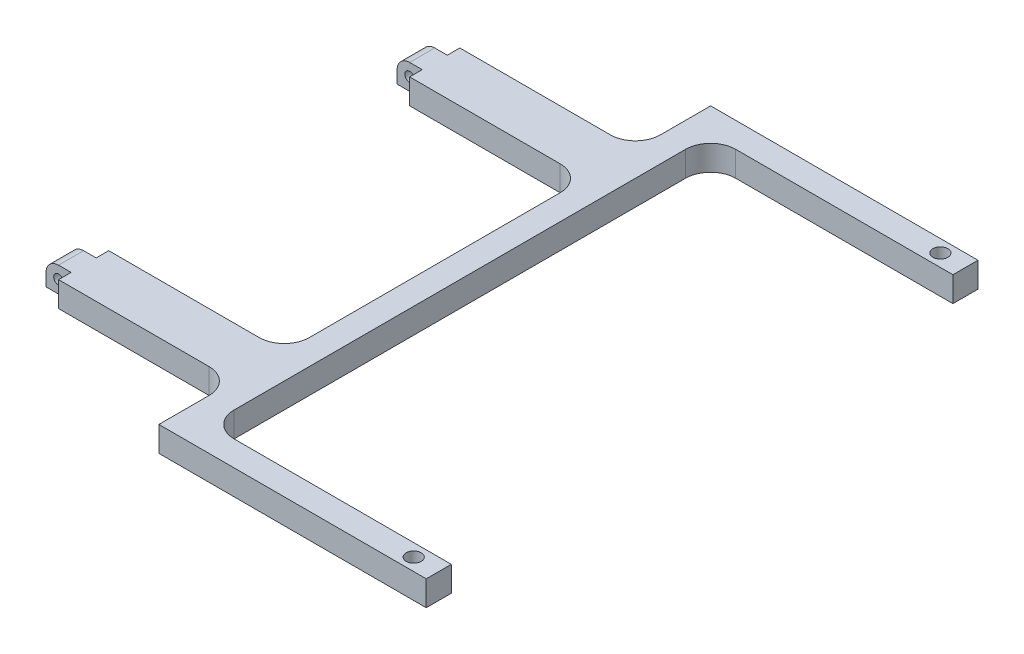
ISO-10303-21;
HEADER;
FILE_DESCRIPTION(('STEP AP214'),'2;1');
FILE_NAME('part.step','',(''),(''),'','','');
FILE_SCHEMA(('AUTOMOTIVE_DESIGN { 1 0 10303 214 1 1 1 1 }'));
ENDSEC;
DATA;
#1=APPLICATION_CONTEXT('core data for automotive mechanical design processes');
#2=APPLICATION_PROTOCOL_DEFINITION('international standard','automotive_design',2000,#1);
#3=PRODUCT_CONTEXT('',#1,'mechanical');
#4=PRODUCT('Part','Part','',(#3));
#5=PRODUCT_RELATED_PRODUCT_CATEGORY('part','',(#4));
#6=PRODUCT_DEFINITION_FORMATION('','',#4);
#7=PRODUCT_DEFINITION_CONTEXT('part definition',#1,'design');
#8=PRODUCT_DEFINITION('design','',#6,#7);
#9=PRODUCT_DEFINITION_SHAPE('','',#8);
#10=(LENGTH_UNIT() NAMED_UNIT(*) SI_UNIT(.MILLI.,.METRE.));
#11=(NAMED_UNIT(*) PLANE_ANGLE_UNIT() SI_UNIT($,.RADIAN.));
#12=(NAMED_UNIT(*) SI_UNIT($,.STERADIAN.) SOLID_ANGLE_UNIT());
#13=UNCERTAINTY_MEASURE_WITH_UNIT(LENGTH_MEASURE(1.E-05),#10,'distance_accuracy_value','');
#14=(GEOMETRIC_REPRESENTATION_CONTEXT(3) GLOBAL_UNCERTAINTY_ASSIGNED_CONTEXT((#13)) GLOBAL_UNIT_ASSIGNED_CONTEXT((#10,
#11,#12)) REPRESENTATION_CONTEXT('',''));
#15=CARTESIAN_POINT('',(0.,0.,0.));
#16=DIRECTION('',(0.,0.,1.));
#17=DIRECTION('',(1.,0.,0.));
#18=AXIS2_PLACEMENT_3D('',#15,#16,#17);
#19=CARTESIAN_POINT('',(-62.4205,0.,47.625));
#20=DIRECTION('',(0.,0.,-1.));
#21=DIRECTION('',(-1.,0.,0.));
#22=AXIS2_PLACEMENT_3D('',#19,#20,#21);
#23=PLANE('',#22);
#24=DIRECTION('',(1.,0.,0.));
#25=VECTOR('',#24,1.);
#26=CARTESIAN_POINT('',(-62.4205,6.35,47.625));
#27=LINE('',#26,#25);
#28=CARTESIAN_POINT('',(-59.2455,6.35,47.625));
#29=VERTEX_POINT('',#28);
#30=CARTESIAN_POINT('',(-56.0705,6.35,47.625));
#31=VERTEX_POINT('',#30);
#32=EDGE_CURVE('E307',#29,#31,#27,.T.);
#33=ORIENTED_EDGE('',*,*,#32,.F.);
#34=CARTESIAN_POINT('',(-59.2455,3.175,47.625));
#35=DIRECTION('',(0.,0.,-1.));
#36=DIRECTION('',(-1.,0.,0.));
#37=AXIS2_PLACEMENT_3D('',#34,#35,#36);
#38=CIRCLE('',#37,3.175);
#39=CARTESIAN_POINT('',(-62.4205,3.175,47.625));
#40=VERTEX_POINT('',#39);
#41=EDGE_CURVE('E11',#29,#40,#38,.F.);
#42=ORIENTED_EDGE('',*,*,#41,.T.);
#43=DIRECTION('',(0.,1.,0.));
#44=VECTOR('',#43,1.);
#45=CARTESIAN_POINT('',(-62.4205,0.,47.625));
#46=LINE('',#45,#44);
#47=CARTESIAN_POINT('',(-62.4205,0.,47.625));
#48=VERTEX_POINT('',#47);
#49=EDGE_CURVE('E293',#48,#40,#46,.T.);
#50=ORIENTED_EDGE('',*,*,#49,.F.);
#51=DIRECTION('',(1.,0.,0.));
#52=VECTOR('',#51,1.);
#53=CARTESIAN_POINT('',(-62.4205,0.,47.625));
#54=LINE('',#53,#52);
#55=CARTESIAN_POINT('',(-56.0705,0.,47.625));
#56=VERTEX_POINT('',#55);
#57=EDGE_CURVE('E299',#48,#56,#54,.T.);
#58=ORIENTED_EDGE('',*,*,#57,.T.);
#59=DIRECTION('',(0.,1.,0.));
#60=VECTOR('',#59,1.);
#61=CARTESIAN_POINT('',(-56.0705,0.,47.625));
#62=LINE('',#61,#60);
#63=EDGE_CURVE('E287',#56,#31,#62,.T.);
#64=ORIENTED_EDGE('',*,*,#63,.T.);
#65=EDGE_LOOP('',(#33,#42,#50,#58,#64));
#66=FACE_BOUND('',#65,.T.);
#67=CARTESIAN_POINT('',(-59.2455,3.175,47.625));
#68=DIRECTION('',(0.,0.,1.));
#69=DIRECTION('',(1.,0.,0.));
#70=AXIS2_PLACEMENT_3D('',#67,#68,#69);
#71=CIRCLE('',#70,1.21919999999998);
#72=CARTESIAN_POINT('',(-58.0263,3.175,47.625));
#73=VERTEX_POINT('',#72);
#74=EDGE_CURVE('E734',#73,#73,#71,.T.);
#75=ORIENTED_EDGE('',*,*,#74,.F.);
#76=EDGE_LOOP('',(#75));
#77=FACE_BOUND('',#76,.T.);
#78=ADVANCED_FACE('F34',(#66,#77),#23,.F.);
#79=CARTESIAN_POINT('',(-56.0705,6.35,-69.85));
#80=DIRECTION('',(1.,0.,0.));
#81=DIRECTION('',(0.,0.,-1.));
#82=AXIS2_PLACEMENT_3D('',#79,#80,#81);
#83=PLANE('',#82);
#84=DIRECTION('',(0.,1.,0.));
#85=VECTOR('',#84,1.);
#86=CARTESIAN_POINT('',(-56.0705,0.,-41.275));
#87=LINE('',#86,#85);
#88=CARTESIAN_POINT('',(-56.0705,0.,-41.275));
#89=VERTEX_POINT('',#88);
#90=CARTESIAN_POINT('',(-56.0705,6.35,-41.275));
#91=VERTEX_POINT('',#90);
#92=EDGE_CURVE('E263',#89,#91,#87,.T.);
#93=ORIENTED_EDGE('',*,*,#92,.F.);
#94=DIRECTION('',(0.,0.,1.));
#95=VECTOR('',#94,1.);
#96=CARTESIAN_POINT('',(-56.0705,0.,-69.85));
#97=LINE('',#96,#95);
#98=CARTESIAN_POINT('',(-56.0705,0.,-38.1));
#99=VERTEX_POINT('',#98);
#100=EDGE_CURVE('E244',#89,#99,#97,.T.);
#101=ORIENTED_EDGE('',*,*,#100,.T.);
#102=DIRECTION('',(0.,1.,0.));
#103=VECTOR('',#102,1.);
#104=CARTESIAN_POINT('',(-56.0705,0.,-38.1));
#105=LINE('',#104,#103);
#106=CARTESIAN_POINT('',(-56.0705,6.35,-38.1));
#107=VERTEX_POINT('',#106);
#108=EDGE_CURVE('E325',#99,#107,#105,.T.);
#109=ORIENTED_EDGE('',*,*,#108,.T.);
#110=DIRECTION('',(0.,0.,1.));
#111=VECTOR('',#110,1.);
#112=CARTESIAN_POINT('',(-56.0705,6.35,-69.85));
#113=LINE('',#112,#111);
#114=EDGE_CURVE('E265',#91,#107,#113,.T.);
#115=ORIENTED_EDGE('',*,*,#114,.F.);
#116=EDGE_LOOP('',(#93,#101,#109,#115));
#117=FACE_BOUND('',#116,.T.);
#118=ADVANCED_FACE('F264',(#117),#83,.F.);
#119=DIRECTION('',(0.,-1.,0.));
#120=VECTOR('',#119,1.);
#121=CARTESIAN_POINT('',(-56.0705,0.,-47.625));
#122=LINE('',#121,#120);
#123=CARTESIAN_POINT('',(-56.0705,6.35,-47.625));
#124=VERTEX_POINT('',#123);
#125=CARTESIAN_POINT('',(-56.0705,0.,-47.625));
#126=VERTEX_POINT('',#125);
#127=EDGE_CURVE('E268',#124,#126,#122,.T.);
#128=ORIENTED_EDGE('',*,*,#127,.F.);
#129=CARTESIAN_POINT('',(-56.0705,6.35,-50.8));
#130=VERTEX_POINT('',#129);
#131=EDGE_CURVE('E391',#130,#124,#113,.T.);
#132=ORIENTED_EDGE('',*,*,#131,.F.);
#133=DIRECTION('',(0.,1.,0.));
#134=VECTOR('',#133,1.);
#135=CARTESIAN_POINT('',(-56.0705,0.,-50.8));
#136=LINE('',#135,#134);
#137=CARTESIAN_POINT('',(-56.0705,0.,-50.8));
#138=VERTEX_POINT('',#137);
#139=EDGE_CURVE('E376',#138,#130,#136,.T.);
#140=ORIENTED_EDGE('',*,*,#139,.F.);
#141=EDGE_CURVE('E257',#138,#126,#97,.T.);
#142=ORIENTED_EDGE('',*,*,#141,.T.);
#143=EDGE_LOOP('',(#128,#132,#140,#142));
#144=FACE_BOUND('',#143,.T.);
#145=ADVANCED_FACE('F526',(#144),#83,.F.);
#146=ORIENTED_EDGE('',*,*,#63,.F.);
#147=CARTESIAN_POINT('',(-56.0705,0.,50.8));
#148=VERTEX_POINT('',#147);
#149=EDGE_CURVE('E260',#56,#148,#97,.T.);
#150=ORIENTED_EDGE('',*,*,#149,.T.);
#151=DIRECTION('',(0.,1.,0.));
#152=VECTOR('',#151,1.);
#153=CARTESIAN_POINT('',(-56.0705,0.,50.8));
#154=LINE('',#153,#152);
#155=CARTESIAN_POINT('',(-56.0705,6.35,50.8));
#156=VERTEX_POINT('',#155);
#157=EDGE_CURVE('E362',#148,#156,#154,.T.);
#158=ORIENTED_EDGE('',*,*,#157,.T.);
#159=EDGE_CURVE('E390',#31,#156,#113,.T.);
#160=ORIENTED_EDGE('',*,*,#159,.F.);
#161=EDGE_LOOP('',(#146,#150,#158,#160));
#162=FACE_BOUND('',#161,.T.);
#163=ADVANCED_FACE('F36',(#162),#83,.F.);
#164=DIRECTION('',(0.,-1.,0.));
#165=VECTOR('',#164,1.);
#166=CARTESIAN_POINT('',(-56.0705,0.,41.275));
#167=LINE('',#166,#165);
#168=CARTESIAN_POINT('',(-56.0705,6.35,41.275));
#169=VERTEX_POINT('',#168);
#170=CARTESIAN_POINT('',(-56.0705,0.,41.275));
#171=VERTEX_POINT('',#170);
#172=EDGE_CURVE('E290',#169,#171,#167,.T.);
#173=ORIENTED_EDGE('',*,*,#172,.F.);
#174=CARTESIAN_POINT('',(-56.0705,6.35,38.1));
#175=VERTEX_POINT('',#174);
#176=EDGE_CURVE('E395',#175,#169,#113,.T.);
#177=ORIENTED_EDGE('',*,*,#176,.F.);
#178=DIRECTION('',(0.,1.,0.));
#179=VECTOR('',#178,1.);
#180=CARTESIAN_POINT('',(-56.0705,0.,38.1));
#181=LINE('',#180,#179);
#182=CARTESIAN_POINT('',(-56.0705,0.,38.1));
#183=VERTEX_POINT('',#182);
#184=EDGE_CURVE('E324',#183,#175,#181,.T.);
#185=ORIENTED_EDGE('',*,*,#184,.F.);
#186=EDGE_CURVE('E258',#183,#171,#97,.T.);
#187=ORIENTED_EDGE('',*,*,#186,.T.);
#188=EDGE_LOOP('',(#173,#177,#185,#187));
#189=FACE_BOUND('',#188,.T.);
#190=ADVANCED_FACE('F523',(#189),#83,.F.);
#191=CARTESIAN_POINT('',(56.0705,6.35,-69.85));
#192=DIRECTION('',(-1.,0.,0.));
#193=DIRECTION('',(0.,0.,1.));
#194=AXIS2_PLACEMENT_3D('',#191,#192,#193);
#195=PLANE('',#194);
#196=DIRECTION('',(0.,0.,-1.));
#197=VECTOR('',#196,1.);
#198=CARTESIAN_POINT('',(56.0705,0.,-69.85));
#199=LINE('',#198,#197);
#200=CARTESIAN_POINT('',(56.0705,0.,69.85));
#201=VERTEX_POINT('',#200);
#202=CARTESIAN_POINT('',(56.0705,0.,63.5));
#203=VERTEX_POINT('',#202);
#204=EDGE_CURVE('E384',#201,#203,#199,.T.);
#205=ORIENTED_EDGE('',*,*,#204,.T.);
#206=DIRECTION('',(0.,1.,0.));
#207=VECTOR('',#206,1.);
#208=CARTESIAN_POINT('',(56.0705,0.,63.5));
#209=LINE('',#208,#207);
#210=CARTESIAN_POINT('',(56.0705,6.35,63.5));
#211=VERTEX_POINT('',#210);
#212=EDGE_CURVE('E345',#203,#211,#209,.T.);
#213=ORIENTED_EDGE('',*,*,#212,.T.);
#214=DIRECTION('',(0.,0.,-1.));
#215=VECTOR('',#214,1.);
#216=CARTESIAN_POINT('',(56.0705,6.35,-69.85));
#217=LINE('',#216,#215);
#218=CARTESIAN_POINT('',(56.0705,6.35,69.85));
#219=VERTEX_POINT('',#218);
#220=EDGE_CURVE('E398',#219,#211,#217,.T.);
#221=ORIENTED_EDGE('',*,*,#220,.F.);
#222=DIRECTION('',(0.,-1.,0.));
#223=VECTOR('',#222,1.);
#224=CARTESIAN_POINT('',(56.0705,6.35,69.85));
#225=LINE('',#224,#223);
#226=EDGE_CURVE('E407',#219,#201,#225,.T.);
#227=ORIENTED_EDGE('',*,*,#226,.T.);
#228=EDGE_LOOP('',(#205,#213,#221,#227));
#229=FACE_BOUND('',#228,.T.);
#230=ADVANCED_FACE('F525',(#229),#195,.F.);
#231=CARTESIAN_POINT('',(-56.0705,6.35,69.85));
#232=DIRECTION('',(0.,0.,-1.));
#233=DIRECTION('',(-1.,0.,0.));
#234=AXIS2_PLACEMENT_3D('',#231,#232,#233);
#235=PLANE('',#234);
#236=DIRECTION('',(1.,0.,0.));
#237=VECTOR('',#236,1.);
#238=CARTESIAN_POINT('',(-56.0705,6.35,69.85));
#239=LINE('',#238,#237);
#240=CARTESIAN_POINT('',(-11.6205,6.35,69.85));
#241=VERTEX_POINT('',#240);
#242=EDGE_CURVE('E394',#241,#219,#239,.T.);
#243=ORIENTED_EDGE('',*,*,#242,.F.);
#244=DIRECTION('',(0.,1.,0.));
#245=VECTOR('',#244,1.);
#246=CARTESIAN_POINT('',(-11.6205,0.,69.85));
#247=LINE('',#246,#245);
#248=CARTESIAN_POINT('',(-11.6205,0.,69.85));
#249=VERTEX_POINT('',#248);
#250=EDGE_CURVE('E361',#249,#241,#247,.T.);
#251=ORIENTED_EDGE('',*,*,#250,.F.);
#252=DIRECTION('',(1.,0.,0.));
#253=VECTOR('',#252,1.);
#254=CARTESIAN_POINT('',(-56.0705,0.,69.85));
#255=LINE('',#254,#253);
#256=EDGE_CURVE('E381',#249,#201,#255,.T.);
#257=ORIENTED_EDGE('',*,*,#256,.T.);
#258=ORIENTED_EDGE('',*,*,#226,.F.);
#259=EDGE_LOOP('',(#243,#251,#257,#258));
#260=FACE_BOUND('',#259,.T.);
#261=ADVANCED_FACE('F531',(#260),#235,.F.);
#262=CARTESIAN_POINT('',(56.0705,6.35,-63.5));
#263=VERTEX_POINT('',#262);
#264=CARTESIAN_POINT('',(56.0705,6.35,-69.85));
#265=VERTEX_POINT('',#264);
#266=EDGE_CURVE('E397',#263,#265,#217,.T.);
#267=ORIENTED_EDGE('',*,*,#266,.F.);
#268=DIRECTION('',(0.,1.,0.));
#269=VECTOR('',#268,1.);
#270=CARTESIAN_POINT('',(56.0705,0.,-63.5));
#271=LINE('',#270,#269);
#272=CARTESIAN_POINT('',(56.0705,0.,-63.5));
#273=VERTEX_POINT('',#272);
#274=EDGE_CURVE('E344',#273,#263,#271,.T.);
#275=ORIENTED_EDGE('',*,*,#274,.F.);
#276=CARTESIAN_POINT('',(56.0705,0.,-69.85));
#277=VERTEX_POINT('',#276);
#278=EDGE_CURVE('E383',#273,#277,#199,.T.);
#279=ORIENTED_EDGE('',*,*,#278,.T.);
#280=DIRECTION('',(0.,-1.,0.));
#281=VECTOR('',#280,1.);
#282=CARTESIAN_POINT('',(56.0705,6.35,-69.85));
#283=LINE('',#282,#281);
#284=EDGE_CURVE('E404',#265,#277,#283,.T.);
#285=ORIENTED_EDGE('',*,*,#284,.F.);
#286=EDGE_LOOP('',(#267,#275,#279,#285));
#287=FACE_BOUND('',#286,.T.);
#288=ADVANCED_FACE('F534',(#287),#195,.F.);
#289=CARTESIAN_POINT('',(-56.0705,6.35,-69.85));
#290=DIRECTION('',(0.,0.,1.));
#291=DIRECTION('',(1.,0.,0.));
#292=AXIS2_PLACEMENT_3D('',#289,#290,#291);
#293=PLANE('',#292);
#294=DIRECTION('',(-1.,0.,0.));
#295=VECTOR('',#294,1.);
#296=CARTESIAN_POINT('',(-56.0705,0.,-69.85));
#297=LINE('',#296,#295);
#298=CARTESIAN_POINT('',(-11.6205,0.,-69.85));
#299=VERTEX_POINT('',#298);
#300=EDGE_CURVE('E387',#277,#299,#297,.T.);
#301=ORIENTED_EDGE('',*,*,#300,.T.);
#302=DIRECTION('',(0.,1.,0.));
#303=VECTOR('',#302,1.);
#304=CARTESIAN_POINT('',(-11.6205,0.,-69.85));
#305=LINE('',#304,#303);
#306=CARTESIAN_POINT('',(-11.6205,6.35,-69.85));
#307=VERTEX_POINT('',#306);
#308=EDGE_CURVE('E377',#299,#307,#305,.T.);
#309=ORIENTED_EDGE('',*,*,#308,.T.);
#310=DIRECTION('',(-1.,0.,0.));
#311=VECTOR('',#310,1.);
#312=CARTESIAN_POINT('',(-56.0705,6.35,-69.85));
#313=LINE('',#312,#311);
#314=EDGE_CURVE('E401',#265,#307,#313,.T.);
#315=ORIENTED_EDGE('',*,*,#314,.F.);
#316=ORIENTED_EDGE('',*,*,#284,.T.);
#317=EDGE_LOOP('',(#301,#309,#315,#316));
#318=FACE_BOUND('',#317,.T.);
#319=ADVANCED_FACE('F604',(#318),#293,.F.);
#320=CARTESIAN_POINT('',(-56.0705,6.35,69.85));
#321=DIRECTION('',(0.,1.,0.));
#322=DIRECTION('',(0.,0.,1.));
#323=AXIS2_PLACEMENT_3D('',#320,#321,#322);
#324=PLANE('',#323);
#325=CARTESIAN_POINT('',(49.7205,6.35,66.675));
#326=DIRECTION('',(0.,1.,0.));
#327=DIRECTION('',(0.,0.,1.));
#328=AXIS2_PLACEMENT_3D('',#325,#326,#327);
#329=CIRCLE('',#328,1.89864999999999);
#330=CARTESIAN_POINT('',(49.7205,6.35,68.57365));
#331=VERTEX_POINT('',#330);
#332=EDGE_CURVE('E699',#331,#331,#329,.T.);
#333=ORIENTED_EDGE('',*,*,#332,.F.);
#334=EDGE_LOOP('',(#333));
#335=FACE_BOUND('',#334,.T.);
#336=CARTESIAN_POINT('',(49.7205,6.35,-66.675));
#337=DIRECTION('',(0.,1.,0.));
#338=DIRECTION('',(0.,0.,1.));
#339=AXIS2_PLACEMENT_3D('',#336,#337,#338);
#340=CIRCLE('',#339,1.89864999999999);
#341=CARTESIAN_POINT('',(49.7205,6.35,-64.77635));
#342=VERTEX_POINT('',#341);
#343=EDGE_CURVE('E269',#342,#342,#340,.T.);
#344=ORIENTED_EDGE('',*,*,#343,.F.);
#345=EDGE_LOOP('',(#344));
#346=FACE_BOUND('',#345,.T.);
#347=DIRECTION('',(1.,0.,0.));
#348=VECTOR('',#347,1.);
#349=CARTESIAN_POINT('',(-62.4205,6.35,-47.625));
#350=LINE('',#349,#348);
#351=CARTESIAN_POINT('',(-59.2455,6.35,-47.625));
#352=VERTEX_POINT('',#351);
#353=EDGE_CURVE('E278',#352,#124,#350,.T.);
#354=ORIENTED_EDGE('',*,*,#353,.F.);
#355=DIRECTION('',(0.,0.,-1.));
#356=VECTOR('',#355,1.);
#357=CARTESIAN_POINT('',(-59.2455,6.35,69.85));
#358=LINE('',#357,#356);
#359=CARTESIAN_POINT('',(-59.2455,6.35,-41.275));
#360=VERTEX_POINT('',#359);
#361=EDGE_CURVE('E471',#352,#360,#358,.F.);
#362=ORIENTED_EDGE('',*,*,#361,.T.);
#363=DIRECTION('',(1.,0.,0.));
#364=VECTOR('',#363,1.);
#365=CARTESIAN_POINT('',(-62.4205,6.35,-41.275));
#366=LINE('',#365,#364);
#367=EDGE_CURVE('E285',#360,#91,#366,.T.);
#368=ORIENTED_EDGE('',*,*,#367,.T.);
#369=ORIENTED_EDGE('',*,*,#114,.T.);
#370=DIRECTION('',(-1.,0.,0.));
#371=VECTOR('',#370,1.);
#372=CARTESIAN_POINT('',(-56.0705,6.35,-38.1));
#373=LINE('',#372,#371);
#374=CARTESIAN_POINT('',(-17.9705,6.35,-38.1));
#375=VERTEX_POINT('',#374);
#376=EDGE_CURVE('E315',#375,#107,#373,.T.);
#377=ORIENTED_EDGE('',*,*,#376,.F.);
#378=CARTESIAN_POINT('',(-17.9705,6.35,-31.75));
#379=DIRECTION('',(0.,1.,0.));
#380=DIRECTION('',(0.,0.,1.));
#381=AXIS2_PLACEMENT_3D('',#378,#379,#380);
#382=CIRCLE('',#381,6.35);
#383=CARTESIAN_POINT('',(-11.6205,6.35,-31.75));
#384=VERTEX_POINT('',#383);
#385=EDGE_CURVE('E460',#375,#384,#382,.F.);
#386=ORIENTED_EDGE('',*,*,#385,.T.);
#387=DIRECTION('',(0.,0.,-1.));
#388=VECTOR('',#387,1.);
#389=CARTESIAN_POINT('',(-11.6205,6.35,-38.1));
#390=LINE('',#389,#388);
#391=CARTESIAN_POINT('',(-11.6205,6.35,31.75));
#392=VERTEX_POINT('',#391);
#393=EDGE_CURVE('E312',#392,#384,#390,.T.);
#394=ORIENTED_EDGE('',*,*,#393,.F.);
#395=CARTESIAN_POINT('',(-17.9705,6.35,31.75));
#396=DIRECTION('',(0.,1.,0.));
#397=DIRECTION('',(0.,0.,1.));
#398=AXIS2_PLACEMENT_3D('',#395,#396,#397);
#399=CIRCLE('',#398,6.35);
#400=CARTESIAN_POINT('',(-17.9705,6.35,38.1));
#401=VERTEX_POINT('',#400);
#402=EDGE_CURVE('E456',#392,#401,#399,.F.);
#403=ORIENTED_EDGE('',*,*,#402,.T.);
#404=DIRECTION('',(1.,0.,0.));
#405=VECTOR('',#404,1.);
#406=CARTESIAN_POINT('',(-56.0705,6.35,38.1));
#407=LINE('',#406,#405);
#408=EDGE_CURVE('E309',#175,#401,#407,.T.);
#409=ORIENTED_EDGE('',*,*,#408,.F.);
#410=ORIENTED_EDGE('',*,*,#176,.T.);
#411=DIRECTION('',(1.,0.,0.));
#412=VECTOR('',#411,1.);
#413=CARTESIAN_POINT('',(-62.4205,6.35,41.275));
#414=LINE('',#413,#412);
#415=CARTESIAN_POINT('',(-59.2455,6.35,41.275));
#416=VERTEX_POINT('',#415);
#417=EDGE_CURVE('E305',#416,#169,#414,.T.);
#418=ORIENTED_EDGE('',*,*,#417,.F.);
#419=DIRECTION('',(0.,0.,-1.));
#420=VECTOR('',#419,1.);
#421=CARTESIAN_POINT('',(-59.2455,6.35,69.85));
#422=LINE('',#421,#420);
#423=EDGE_CURVE('E469',#416,#29,#422,.F.);
#424=ORIENTED_EDGE('',*,*,#423,.T.);
#425=ORIENTED_EDGE('',*,*,#32,.T.);
#426=ORIENTED_EDGE('',*,*,#159,.T.);
#427=DIRECTION('',(-1.,0.,0.));
#428=VECTOR('',#427,1.);
#429=CARTESIAN_POINT('',(-56.0705,6.35,50.8));
#430=LINE('',#429,#428);
#431=CARTESIAN_POINT('',(-17.9705,6.35,50.8));
#432=VERTEX_POINT('',#431);
#433=EDGE_CURVE('E352',#432,#156,#430,.T.);
#434=ORIENTED_EDGE('',*,*,#433,.F.);
#435=CARTESIAN_POINT('',(-17.9705,6.35,57.15));
#436=DIRECTION('',(0.,1.,0.));
#437=DIRECTION('',(0.,0.,1.));
#438=AXIS2_PLACEMENT_3D('',#435,#436,#437);
#439=CIRCLE('',#438,6.35);
#440=CARTESIAN_POINT('',(-11.6205,6.35,57.15));
#441=VERTEX_POINT('',#440);
#442=EDGE_CURVE('E452',#432,#441,#439,.F.);
#443=ORIENTED_EDGE('',*,*,#442,.T.);
#444=DIRECTION('',(0.,0.,-1.));
#445=VECTOR('',#444,1.);
#446=CARTESIAN_POINT('',(-11.6205,6.35,69.85));
#447=LINE('',#446,#445);
#448=EDGE_CURVE('E348',#241,#441,#447,.T.);
#449=ORIENTED_EDGE('',*,*,#448,.F.);
#450=ORIENTED_EDGE('',*,*,#242,.T.);
#451=ORIENTED_EDGE('',*,*,#220,.T.);
#452=DIRECTION('',(1.,0.,0.));
#453=VECTOR('',#452,1.);
#454=CARTESIAN_POINT('',(56.0705,6.35,63.5));
#455=LINE('',#454,#453);
#456=CARTESIAN_POINT('',(1.0795,6.35,63.5));
#457=VERTEX_POINT('',#456);
#458=EDGE_CURVE('E334',#457,#211,#455,.T.);
#459=ORIENTED_EDGE('',*,*,#458,.F.);
#460=CARTESIAN_POINT('',(1.07949999999999,6.35,57.15));
#461=DIRECTION('',(0.,1.,0.));
#462=DIRECTION('',(0.,0.,1.));
#463=AXIS2_PLACEMENT_3D('',#460,#461,#462);
#464=CIRCLE('',#463,6.35);
#465=CARTESIAN_POINT('',(-5.27050000000001,6.35,57.15));
#466=VERTEX_POINT('',#465);
#467=EDGE_CURVE('E440',#457,#466,#464,.F.);
#468=ORIENTED_EDGE('',*,*,#467,.T.);
#469=DIRECTION('',(0.,0.,1.));
#470=VECTOR('',#469,1.);
#471=CARTESIAN_POINT('',(-5.27050000000001,6.35,-63.5));
#472=LINE('',#471,#470);
#473=CARTESIAN_POINT('',(-5.27050000000001,6.35,-57.15));
#474=VERTEX_POINT('',#473);
#475=EDGE_CURVE('E331',#474,#466,#472,.T.);
#476=ORIENTED_EDGE('',*,*,#475,.F.);
#477=CARTESIAN_POINT('',(1.07949999999999,6.35,-57.15));
#478=DIRECTION('',(0.,1.,0.));
#479=DIRECTION('',(0.,0.,1.));
#480=AXIS2_PLACEMENT_3D('',#477,#478,#479);
#481=CIRCLE('',#480,6.35);
#482=CARTESIAN_POINT('',(1.0795,6.35,-63.5));
#483=VERTEX_POINT('',#482);
#484=EDGE_CURVE('E444',#474,#483,#481,.F.);
#485=ORIENTED_EDGE('',*,*,#484,.T.);
#486=DIRECTION('',(-1.,0.,0.));
#487=VECTOR('',#486,1.);
#488=CARTESIAN_POINT('',(56.0705,6.35,-63.5));
#489=LINE('',#488,#487);
#490=EDGE_CURVE('E327',#263,#483,#489,.T.);
#491=ORIENTED_EDGE('',*,*,#490,.F.);
#492=ORIENTED_EDGE('',*,*,#266,.T.);
#493=ORIENTED_EDGE('',*,*,#314,.T.);
#494=DIRECTION('',(0.,0.,-1.));
#495=VECTOR('',#494,1.);
#496=CARTESIAN_POINT('',(-11.6205,6.35,-69.85));
#497=LINE('',#496,#495);
#498=CARTESIAN_POINT('',(-11.6205,6.35,-57.15));
#499=VERTEX_POINT('',#498);
#500=EDGE_CURVE('E369',#499,#307,#497,.T.);
#501=ORIENTED_EDGE('',*,*,#500,.F.);
#502=CARTESIAN_POINT('',(-17.9705,6.35,-57.15));
#503=DIRECTION('',(0.,1.,0.));
#504=DIRECTION('',(0.,0.,1.));
#505=AXIS2_PLACEMENT_3D('',#502,#503,#504);
#506=CIRCLE('',#505,6.35);
#507=CARTESIAN_POINT('',(-17.9705,6.35,-50.8));
#508=VERTEX_POINT('',#507);
#509=EDGE_CURVE('E448',#499,#508,#506,.F.);
#510=ORIENTED_EDGE('',*,*,#509,.T.);
#511=DIRECTION('',(1.,0.,0.));
#512=VECTOR('',#511,1.);
#513=CARTESIAN_POINT('',(-56.0705,6.35,-50.8));
#514=LINE('',#513,#512);
#515=EDGE_CURVE('E365',#130,#508,#514,.T.);
#516=ORIENTED_EDGE('',*,*,#515,.F.);
#517=ORIENTED_EDGE('',*,*,#131,.T.);
#518=EDGE_LOOP('',(#354,#362,#368,#369,#377,#386,#394,#403,#409,#410,#418,#424,#425,#426,#434,
#443,#449,#450,#451,#459,#468,#476,#485,#491,#492,#493,#501,#510,#516,#517));
#519=FACE_BOUND('',#518,.T.);
#520=ADVANCED_FACE('F486',(#335,#346,#519),#324,.T.);
#521=CARTESIAN_POINT('',(-56.0705,0.,69.85));
#522=DIRECTION('',(0.,1.,0.));
#523=DIRECTION('',(0.,0.,1.));
#524=AXIS2_PLACEMENT_3D('',#521,#522,#523);
#525=PLANE('',#524);
#526=CARTESIAN_POINT('',(49.7205,0.,66.675));
#527=DIRECTION('',(0.,-1.,0.));
#528=DIRECTION('',(0.,0.,-1.));
#529=AXIS2_PLACEMENT_3D('',#526,#527,#528);
#530=CIRCLE('',#529,1.89864999999999);
#531=CARTESIAN_POINT('',(49.7205,0.,64.77635));
#532=VERTEX_POINT('',#531);
#533=EDGE_CURVE('E695',#532,#532,#530,.T.);
#534=ORIENTED_EDGE('',*,*,#533,.F.);
#535=EDGE_LOOP('',(#534));
#536=FACE_BOUND('',#535,.T.);
#537=CARTESIAN_POINT('',(49.7205,0.,-66.675));
#538=DIRECTION('',(0.,-1.,0.));
#539=DIRECTION('',(0.,0.,-1.));
#540=AXIS2_PLACEMENT_3D('',#537,#538,#539);
#541=CIRCLE('',#540,1.89864999999999);
#542=CARTESIAN_POINT('',(49.7205,0.,-68.57365));
#543=VERTEX_POINT('',#542);
#544=EDGE_CURVE('E707',#543,#543,#541,.T.);
#545=ORIENTED_EDGE('',*,*,#544,.F.);
#546=EDGE_LOOP('',(#545));
#547=FACE_BOUND('',#546,.T.);
#548=DIRECTION('',(1.,0.,0.));
#549=VECTOR('',#548,1.);
#550=CARTESIAN_POINT('',(-56.0705,0.,38.1));
#551=LINE('',#550,#549);
#552=CARTESIAN_POINT('',(-17.9705,0.,38.1));
#553=VERTEX_POINT('',#552);
#554=EDGE_CURVE('E318',#183,#553,#551,.T.);
#555=ORIENTED_EDGE('',*,*,#554,.T.);
#556=CARTESIAN_POINT('',(-17.9705,0.,31.75));
#557=DIRECTION('',(0.,1.,0.));
#558=DIRECTION('',(0.,0.,1.));
#559=AXIS2_PLACEMENT_3D('',#556,#557,#558);
#560=CIRCLE('',#559,6.35);
#561=CARTESIAN_POINT('',(-11.6205,0.,31.75));
#562=VERTEX_POINT('',#561);
#563=EDGE_CURVE('E458',#553,#562,#560,.T.);
#564=ORIENTED_EDGE('',*,*,#563,.T.);
#565=DIRECTION('',(0.,0.,-1.));
#566=VECTOR('',#565,1.);
#567=CARTESIAN_POINT('',(-11.6205,0.,-38.1));
#568=LINE('',#567,#566);
#569=CARTESIAN_POINT('',(-11.6205,0.,-31.75));
#570=VERTEX_POINT('',#569);
#571=EDGE_CURVE('E320',#562,#570,#568,.T.);
#572=ORIENTED_EDGE('',*,*,#571,.T.);
#573=CARTESIAN_POINT('',(-17.9705,0.,-31.75));
#574=DIRECTION('',(0.,1.,0.));
#575=DIRECTION('',(0.,0.,1.));
#576=AXIS2_PLACEMENT_3D('',#573,#574,#575);
#577=CIRCLE('',#576,6.35);
#578=CARTESIAN_POINT('',(-17.9705,0.,-38.1));
#579=VERTEX_POINT('',#578);
#580=EDGE_CURVE('E462',#570,#579,#577,.T.);
#581=ORIENTED_EDGE('',*,*,#580,.T.);
#582=DIRECTION('',(-1.,0.,0.));
#583=VECTOR('',#582,1.);
#584=CARTESIAN_POINT('',(-56.0705,0.,-38.1));
#585=LINE('',#584,#583);
#586=EDGE_CURVE('E253',#579,#99,#585,.T.);
#587=ORIENTED_EDGE('',*,*,#586,.T.);
#588=ORIENTED_EDGE('',*,*,#100,.F.);
#589=DIRECTION('',(1.,0.,0.));
#590=VECTOR('',#589,1.);
#591=CARTESIAN_POINT('',(-62.4205,0.,-41.275));
#592=LINE('',#591,#590);
#593=CARTESIAN_POINT('',(-62.4205,0.,-41.275));
#594=VERTEX_POINT('',#593);
#595=EDGE_CURVE('E250',#594,#89,#592,.T.);
#596=ORIENTED_EDGE('',*,*,#595,.F.);
#597=DIRECTION('',(0.,0.,1.));
#598=VECTOR('',#597,1.);
#599=CARTESIAN_POINT('',(-62.4205,0.,-41.275));
#600=LINE('',#599,#598);
#601=CARTESIAN_POINT('',(-62.4205,0.,-47.625));
#602=VERTEX_POINT('',#601);
#603=EDGE_CURVE('E275',#602,#594,#600,.T.);
#604=ORIENTED_EDGE('',*,*,#603,.F.);
#605=DIRECTION('',(1.,0.,0.));
#606=VECTOR('',#605,1.);
#607=CARTESIAN_POINT('',(-62.4205,0.,-47.625));
#608=LINE('',#607,#606);
#609=EDGE_CURVE('E274',#602,#126,#608,.T.);
#610=ORIENTED_EDGE('',*,*,#609,.T.);
#611=ORIENTED_EDGE('',*,*,#141,.F.);
#612=DIRECTION('',(1.,0.,0.));
#613=VECTOR('',#612,1.);
#614=CARTESIAN_POINT('',(-56.0705,0.,-50.8));
#615=LINE('',#614,#613);
#616=CARTESIAN_POINT('',(-17.9705,0.,-50.8));
#617=VERTEX_POINT('',#616);
#618=EDGE_CURVE('E371',#138,#617,#615,.T.);
#619=ORIENTED_EDGE('',*,*,#618,.T.);
#620=CARTESIAN_POINT('',(-17.9705,0.,-57.15));
#621=DIRECTION('',(0.,1.,0.));
#622=DIRECTION('',(0.,0.,1.));
#623=AXIS2_PLACEMENT_3D('',#620,#621,#622);
#624=CIRCLE('',#623,6.35);
#625=CARTESIAN_POINT('',(-11.6205,0.,-57.15));
#626=VERTEX_POINT('',#625);
#627=EDGE_CURVE('E450',#617,#626,#624,.T.);
#628=ORIENTED_EDGE('',*,*,#627,.T.);
#629=DIRECTION('',(0.,0.,-1.));
#630=VECTOR('',#629,1.);
#631=CARTESIAN_POINT('',(-11.6205,0.,-69.85));
#632=LINE('',#631,#630);
#633=EDGE_CURVE('E374',#626,#299,#632,.T.);
#634=ORIENTED_EDGE('',*,*,#633,.T.);
#635=ORIENTED_EDGE('',*,*,#300,.F.);
#636=ORIENTED_EDGE('',*,*,#278,.F.);
#637=DIRECTION('',(-1.,0.,0.));
#638=VECTOR('',#637,1.);
#639=CARTESIAN_POINT('',(56.0705,0.,-63.5));
#640=LINE('',#639,#638);
#641=CARTESIAN_POINT('',(1.0795,0.,-63.5));
#642=VERTEX_POINT('',#641);
#643=EDGE_CURVE('E336',#273,#642,#640,.T.);
#644=ORIENTED_EDGE('',*,*,#643,.T.);
#645=CARTESIAN_POINT('',(1.07949999999999,0.,-57.15));
#646=DIRECTION('',(0.,1.,0.));
#647=DIRECTION('',(0.,0.,1.));
#648=AXIS2_PLACEMENT_3D('',#645,#646,#647);
#649=CIRCLE('',#648,6.35);
#650=CARTESIAN_POINT('',(-5.27050000000001,0.,-57.15));
#651=VERTEX_POINT('',#650);
#652=EDGE_CURVE('E446',#642,#651,#649,.T.);
#653=ORIENTED_EDGE('',*,*,#652,.T.);
#654=DIRECTION('',(0.,0.,1.));
#655=VECTOR('',#654,1.);
#656=CARTESIAN_POINT('',(-5.27050000000001,0.,-63.5));
#657=LINE('',#656,#655);
#658=CARTESIAN_POINT('',(-5.27050000000001,0.,57.15));
#659=VERTEX_POINT('',#658);
#660=EDGE_CURVE('E339',#651,#659,#657,.T.);
#661=ORIENTED_EDGE('',*,*,#660,.T.);
#662=CARTESIAN_POINT('',(1.07949999999999,0.,57.15));
#663=DIRECTION('',(0.,1.,0.));
#664=DIRECTION('',(0.,0.,1.));
#665=AXIS2_PLACEMENT_3D('',#662,#663,#664);
#666=CIRCLE('',#665,6.35);
#667=CARTESIAN_POINT('',(1.0795,0.,63.5));
#668=VERTEX_POINT('',#667);
#669=EDGE_CURVE('E442',#659,#668,#666,.T.);
#670=ORIENTED_EDGE('',*,*,#669,.T.);
#671=DIRECTION('',(1.,0.,0.));
#672=VECTOR('',#671,1.);
#673=CARTESIAN_POINT('',(56.0705,0.,63.5));
#674=LINE('',#673,#672);
#675=EDGE_CURVE('E342',#668,#203,#674,.T.);
#676=ORIENTED_EDGE('',*,*,#675,.T.);
#677=ORIENTED_EDGE('',*,*,#204,.F.);
#678=ORIENTED_EDGE('',*,*,#256,.F.);
#679=DIRECTION('',(0.,0.,-1.));
#680=VECTOR('',#679,1.);
#681=CARTESIAN_POINT('',(-11.6205,0.,69.85));
#682=LINE('',#681,#680);
#683=CARTESIAN_POINT('',(-11.6205,0.,57.15));
#684=VERTEX_POINT('',#683);
#685=EDGE_CURVE('E355',#249,#684,#682,.T.);
#686=ORIENTED_EDGE('',*,*,#685,.T.);
#687=CARTESIAN_POINT('',(-17.9705,0.,57.15));
#688=DIRECTION('',(0.,1.,0.));
#689=DIRECTION('',(0.,0.,1.));
#690=AXIS2_PLACEMENT_3D('',#687,#688,#689);
#691=CIRCLE('',#690,6.35);
#692=CARTESIAN_POINT('',(-17.9705,0.,50.8));
#693=VERTEX_POINT('',#692);
#694=EDGE_CURVE('E454',#684,#693,#691,.T.);
#695=ORIENTED_EDGE('',*,*,#694,.T.);
#696=DIRECTION('',(-1.,0.,0.));
#697=VECTOR('',#696,1.);
#698=CARTESIAN_POINT('',(-56.0705,0.,50.8));
#699=LINE('',#698,#697);
#700=EDGE_CURVE('E358',#693,#148,#699,.T.);
#701=ORIENTED_EDGE('',*,*,#700,.T.);
#702=ORIENTED_EDGE('',*,*,#149,.F.);
#703=ORIENTED_EDGE('',*,*,#57,.F.);
#704=DIRECTION('',(0.,0.,1.));
#705=VECTOR('',#704,1.);
#706=CARTESIAN_POINT('',(-62.4205,0.,47.625));
#707=LINE('',#706,#705);
#708=CARTESIAN_POINT('',(-62.4205,0.,41.275));
#709=VERTEX_POINT('',#708);
#710=EDGE_CURVE('E297',#709,#48,#707,.T.);
#711=ORIENTED_EDGE('',*,*,#710,.F.);
#712=DIRECTION('',(1.,0.,0.));
#713=VECTOR('',#712,1.);
#714=CARTESIAN_POINT('',(-62.4205,0.,41.275));
#715=LINE('',#714,#713);
#716=EDGE_CURVE('E302',#709,#171,#715,.T.);
#717=ORIENTED_EDGE('',*,*,#716,.T.);
#718=ORIENTED_EDGE('',*,*,#186,.F.);
#719=EDGE_LOOP('',(#555,#564,#572,#581,#587,#588,#596,#604,#610,#611,#619,#628,#634,#635,#636,
#644,#653,#661,#670,#676,#677,#678,#686,#695,#701,#702,#703,#711,#717,#718));
#720=FACE_BOUND('',#719,.T.);
#721=ADVANCED_FACE('F247',(#536,#547,#720),#525,.F.);
#722=CARTESIAN_POINT('',(-11.6205,0.,-69.85));
#723=DIRECTION('',(1.,0.,0.));
#724=DIRECTION('',(0.,0.,-1.));
#725=AXIS2_PLACEMENT_3D('',#722,#723,#724);
#726=PLANE('',#725);
#727=ORIENTED_EDGE('',*,*,#633,.F.);
#728=DIRECTION('',(0.,1.,0.));
#729=VECTOR('',#728,1.);
#730=CARTESIAN_POINT('',(-11.6205,6.35,-57.15));
#731=LINE('',#730,#729);
#732=EDGE_CURVE('E420',#626,#499,#731,.T.);
#733=ORIENTED_EDGE('',*,*,#732,.T.);
#734=ORIENTED_EDGE('',*,*,#500,.T.);
#735=ORIENTED_EDGE('',*,*,#308,.F.);
#736=EDGE_LOOP('',(#727,#733,#734,#735));
#737=FACE_BOUND('',#736,.T.);
#738=ADVANCED_FACE('F592',(#737),#726,.F.);
#739=CARTESIAN_POINT('',(-56.0705,0.,-50.8));
#740=DIRECTION('',(0.,0.,1.));
#741=DIRECTION('',(1.,0.,0.));
#742=AXIS2_PLACEMENT_3D('',#739,#740,#741);
#743=PLANE('',#742);
#744=ORIENTED_EDGE('',*,*,#515,.T.);
#745=DIRECTION('',(0.,1.,0.));
#746=VECTOR('',#745,1.);
#747=CARTESIAN_POINT('',(-17.9705,0.,-50.8));
#748=LINE('',#747,#746);
#749=EDGE_CURVE('E423',#508,#617,#748,.F.);
#750=ORIENTED_EDGE('',*,*,#749,.T.);
#751=ORIENTED_EDGE('',*,*,#618,.F.);
#752=ORIENTED_EDGE('',*,*,#139,.T.);
#753=EDGE_LOOP('',(#744,#750,#751,#752));
#754=FACE_BOUND('',#753,.T.);
#755=ADVANCED_FACE('F587',(#754),#743,.F.);
#756=CARTESIAN_POINT('',(-56.0705,0.,50.8));
#757=DIRECTION('',(0.,0.,-1.));
#758=DIRECTION('',(-1.,0.,0.));
#759=AXIS2_PLACEMENT_3D('',#756,#757,#758);
#760=PLANE('',#759);
#761=ORIENTED_EDGE('',*,*,#700,.F.);
#762=DIRECTION('',(0.,1.,0.));
#763=VECTOR('',#762,1.);
#764=CARTESIAN_POINT('',(-17.9705,6.35,50.8));
#765=LINE('',#764,#763);
#766=EDGE_CURVE('E425',#693,#432,#765,.T.);
#767=ORIENTED_EDGE('',*,*,#766,.T.);
#768=ORIENTED_EDGE('',*,*,#433,.T.);
#769=ORIENTED_EDGE('',*,*,#157,.F.);
#770=EDGE_LOOP('',(#761,#767,#768,#769));
#771=FACE_BOUND('',#770,.T.);
#772=ADVANCED_FACE('F584',(#771),#760,.F.);
#773=CARTESIAN_POINT('',(-11.6205,0.,69.85));
#774=DIRECTION('',(1.,0.,0.));
#775=DIRECTION('',(0.,0.,-1.));
#776=AXIS2_PLACEMENT_3D('',#773,#774,#775);
#777=PLANE('',#776);
#778=ORIENTED_EDGE('',*,*,#448,.T.);
#779=DIRECTION('',(0.,1.,0.));
#780=VECTOR('',#779,1.);
#781=CARTESIAN_POINT('',(-11.6205,0.,57.15));
#782=LINE('',#781,#780);
#783=EDGE_CURVE('E428',#441,#684,#782,.F.);
#784=ORIENTED_EDGE('',*,*,#783,.T.);
#785=ORIENTED_EDGE('',*,*,#685,.F.);
#786=ORIENTED_EDGE('',*,*,#250,.T.);
#787=EDGE_LOOP('',(#778,#784,#785,#786));
#788=FACE_BOUND('',#787,.T.);
#789=ADVANCED_FACE('F576',(#788),#777,.F.);
#790=CARTESIAN_POINT('',(56.0705,0.,63.5));
#791=DIRECTION('',(0.,0.,1.));
#792=DIRECTION('',(1.,0.,0.));
#793=AXIS2_PLACEMENT_3D('',#790,#791,#792);
#794=PLANE('',#793);
#795=ORIENTED_EDGE('',*,*,#675,.F.);
#796=DIRECTION('',(0.,1.,0.));
#797=VECTOR('',#796,1.);
#798=CARTESIAN_POINT('',(1.07949999999999,6.35,63.5));
#799=LINE('',#798,#797);
#800=EDGE_CURVE('E410',#668,#457,#799,.T.);
#801=ORIENTED_EDGE('',*,*,#800,.T.);
#802=ORIENTED_EDGE('',*,*,#458,.T.);
#803=ORIENTED_EDGE('',*,*,#212,.F.);
#804=EDGE_LOOP('',(#795,#801,#802,#803));
#805=FACE_BOUND('',#804,.T.);
#806=ADVANCED_FACE('F572',(#805),#794,.F.);
#807=CARTESIAN_POINT('',(-5.27050000000001,0.,-63.5));
#808=DIRECTION('',(-1.,0.,0.));
#809=DIRECTION('',(0.,0.,1.));
#810=AXIS2_PLACEMENT_3D('',#807,#808,#809);
#811=PLANE('',#810);
#812=ORIENTED_EDGE('',*,*,#475,.T.);
#813=DIRECTION('',(0.,1.,0.));
#814=VECTOR('',#813,1.);
#815=CARTESIAN_POINT('',(-5.27050000000001,0.,57.15));
#816=LINE('',#815,#814);
#817=EDGE_CURVE('E416',#466,#659,#816,.F.);
#818=ORIENTED_EDGE('',*,*,#817,.T.);
#819=ORIENTED_EDGE('',*,*,#660,.F.);
#820=DIRECTION('',(0.,1.,0.));
#821=VECTOR('',#820,1.);
#822=CARTESIAN_POINT('',(-5.27050000000001,6.35,-57.15));
#823=LINE('',#822,#821);
#824=EDGE_CURVE('E413',#651,#474,#823,.T.);
#825=ORIENTED_EDGE('',*,*,#824,.T.);
#826=EDGE_LOOP('',(#812,#818,#819,#825));
#827=FACE_BOUND('',#826,.T.);
#828=ADVANCED_FACE('F575',(#827),#811,.F.);
#829=CARTESIAN_POINT('',(56.0705,0.,-63.5));
#830=DIRECTION('',(0.,0.,-1.));
#831=DIRECTION('',(-1.,0.,0.));
#832=AXIS2_PLACEMENT_3D('',#829,#830,#831);
#833=PLANE('',#832);
#834=ORIENTED_EDGE('',*,*,#490,.T.);
#835=DIRECTION('',(0.,1.,0.));
#836=VECTOR('',#835,1.);
#837=CARTESIAN_POINT('',(1.07949999999999,0.,-63.5));
#838=LINE('',#837,#836);
#839=EDGE_CURVE('E418',#483,#642,#838,.F.);
#840=ORIENTED_EDGE('',*,*,#839,.T.);
#841=ORIENTED_EDGE('',*,*,#643,.F.);
#842=ORIENTED_EDGE('',*,*,#274,.T.);
#843=EDGE_LOOP('',(#834,#840,#841,#842));
#844=FACE_BOUND('',#843,.T.);
#845=ADVANCED_FACE('F567',(#844),#833,.F.);
#846=CARTESIAN_POINT('',(-56.0705,0.,-38.1));
#847=DIRECTION('',(0.,0.,-1.));
#848=DIRECTION('',(-1.,0.,0.));
#849=AXIS2_PLACEMENT_3D('',#846,#847,#848);
#850=PLANE('',#849);
#851=ORIENTED_EDGE('',*,*,#586,.F.);
#852=DIRECTION('',(0.,1.,0.));
#853=VECTOR('',#852,1.);
#854=CARTESIAN_POINT('',(-17.9705,6.35,-38.1));
#855=LINE('',#854,#853);
#856=EDGE_CURVE('E437',#579,#375,#855,.T.);
#857=ORIENTED_EDGE('',*,*,#856,.T.);
#858=ORIENTED_EDGE('',*,*,#376,.T.);
#859=ORIENTED_EDGE('',*,*,#108,.F.);
#860=EDGE_LOOP('',(#851,#857,#858,#859));
#861=FACE_BOUND('',#860,.T.);
#862=ADVANCED_FACE('F503',(#861),#850,.F.);
#863=CARTESIAN_POINT('',(-11.6205,0.,-38.1));
#864=DIRECTION('',(1.,0.,0.));
#865=DIRECTION('',(0.,0.,-1.));
#866=AXIS2_PLACEMENT_3D('',#863,#864,#865);
#867=PLANE('',#866);
#868=ORIENTED_EDGE('',*,*,#571,.F.);
#869=DIRECTION('',(0.,1.,0.));
#870=VECTOR('',#869,1.);
#871=CARTESIAN_POINT('',(-11.6205,6.35,31.75));
#872=LINE('',#871,#870);
#873=EDGE_CURVE('E432',#562,#392,#872,.T.);
#874=ORIENTED_EDGE('',*,*,#873,.T.);
#875=ORIENTED_EDGE('',*,*,#393,.T.);
#876=DIRECTION('',(0.,1.,0.));
#877=VECTOR('',#876,1.);
#878=CARTESIAN_POINT('',(-11.6205,0.,-31.75));
#879=LINE('',#878,#877);
#880=EDGE_CURVE('E430',#384,#570,#879,.F.);
#881=ORIENTED_EDGE('',*,*,#880,.T.);
#882=EDGE_LOOP('',(#868,#874,#875,#881));
#883=FACE_BOUND('',#882,.T.);
#884=ADVANCED_FACE('F512',(#883),#867,.F.);
#885=CARTESIAN_POINT('',(-56.0705,0.,38.1));
#886=DIRECTION('',(0.,0.,1.));
#887=DIRECTION('',(1.,0.,0.));
#888=AXIS2_PLACEMENT_3D('',#885,#886,#887);
#889=PLANE('',#888);
#890=ORIENTED_EDGE('',*,*,#408,.T.);
#891=DIRECTION('',(0.,1.,0.));
#892=VECTOR('',#891,1.);
#893=CARTESIAN_POINT('',(-17.9705,0.,38.1));
#894=LINE('',#893,#892);
#895=EDGE_CURVE('E435',#401,#553,#894,.F.);
#896=ORIENTED_EDGE('',*,*,#895,.T.);
#897=ORIENTED_EDGE('',*,*,#554,.F.);
#898=ORIENTED_EDGE('',*,*,#184,.T.);
#899=EDGE_LOOP('',(#890,#896,#897,#898));
#900=FACE_BOUND('',#899,.T.);
#901=ADVANCED_FACE('F519',(#900),#889,.F.);
#902=CARTESIAN_POINT('',(1.07949999999999,0.,57.15));
#903=DIRECTION('',(0.,-1.,0.));
#904=DIRECTION('',(0.,0.,-1.));
#905=AXIS2_PLACEMENT_3D('',#902,#903,#904);
#906=CYLINDRICAL_SURFACE('',#905,6.35);
#907=ORIENTED_EDGE('',*,*,#669,.F.);
#908=ORIENTED_EDGE('',*,*,#817,.F.);
#909=ORIENTED_EDGE('',*,*,#467,.F.);
#910=ORIENTED_EDGE('',*,*,#800,.F.);
#911=EDGE_LOOP('',(#907,#908,#909,#910));
#912=FACE_BOUND('',#911,.T.);
#913=ADVANCED_FACE('F560',(#912),#906,.F.);
#914=CARTESIAN_POINT('',(1.07949999999999,0.,-57.15));
#915=DIRECTION('',(0.,-1.,0.));
#916=DIRECTION('',(0.,0.,-1.));
#917=AXIS2_PLACEMENT_3D('',#914,#915,#916);
#918=CYLINDRICAL_SURFACE('',#917,6.35);
#919=ORIENTED_EDGE('',*,*,#652,.F.);
#920=ORIENTED_EDGE('',*,*,#839,.F.);
#921=ORIENTED_EDGE('',*,*,#484,.F.);
#922=ORIENTED_EDGE('',*,*,#824,.F.);
#923=EDGE_LOOP('',(#919,#920,#921,#922));
#924=FACE_BOUND('',#923,.T.);
#925=ADVANCED_FACE('F556',(#924),#918,.F.);
#926=CARTESIAN_POINT('',(-17.9705,0.,-57.15));
#927=DIRECTION('',(0.,-1.,0.));
#928=DIRECTION('',(0.,0.,-1.));
#929=AXIS2_PLACEMENT_3D('',#926,#927,#928);
#930=CYLINDRICAL_SURFACE('',#929,6.35);
#931=ORIENTED_EDGE('',*,*,#627,.F.);
#932=ORIENTED_EDGE('',*,*,#749,.F.);
#933=ORIENTED_EDGE('',*,*,#509,.F.);
#934=ORIENTED_EDGE('',*,*,#732,.F.);
#935=EDGE_LOOP('',(#931,#932,#933,#934));
#936=FACE_BOUND('',#935,.T.);
#937=ADVANCED_FACE('F552',(#936),#930,.F.);
#938=CARTESIAN_POINT('',(-17.9705,0.,57.15));
#939=DIRECTION('',(0.,-1.,0.));
#940=DIRECTION('',(0.,0.,-1.));
#941=AXIS2_PLACEMENT_3D('',#938,#939,#940);
#942=CYLINDRICAL_SURFACE('',#941,6.35);
#943=ORIENTED_EDGE('',*,*,#694,.F.);
#944=ORIENTED_EDGE('',*,*,#783,.F.);
#945=ORIENTED_EDGE('',*,*,#442,.F.);
#946=ORIENTED_EDGE('',*,*,#766,.F.);
#947=EDGE_LOOP('',(#943,#944,#945,#946));
#948=FACE_BOUND('',#947,.T.);
#949=ADVANCED_FACE('F549',(#948),#942,.F.);
#950=CARTESIAN_POINT('',(-17.9705,0.,31.75));
#951=DIRECTION('',(0.,-1.,0.));
#952=DIRECTION('',(0.,0.,-1.));
#953=AXIS2_PLACEMENT_3D('',#950,#951,#952);
#954=CYLINDRICAL_SURFACE('',#953,6.35);
#955=ORIENTED_EDGE('',*,*,#563,.F.);
#956=ORIENTED_EDGE('',*,*,#895,.F.);
#957=ORIENTED_EDGE('',*,*,#402,.F.);
#958=ORIENTED_EDGE('',*,*,#873,.F.);
#959=EDGE_LOOP('',(#955,#956,#957,#958));
#960=FACE_BOUND('',#959,.T.);
#961=ADVANCED_FACE('F516',(#960),#954,.F.);
#962=CARTESIAN_POINT('',(-17.9705,0.,-31.75));
#963=DIRECTION('',(0.,-1.,0.));
#964=DIRECTION('',(0.,0.,-1.));
#965=AXIS2_PLACEMENT_3D('',#962,#963,#964);
#966=CYLINDRICAL_SURFACE('',#965,6.35);
#967=ORIENTED_EDGE('',*,*,#580,.F.);
#968=ORIENTED_EDGE('',*,*,#880,.F.);
#969=ORIENTED_EDGE('',*,*,#385,.F.);
#970=ORIENTED_EDGE('',*,*,#856,.F.);
#971=EDGE_LOOP('',(#967,#968,#969,#970));
#972=FACE_BOUND('',#971,.T.);
#973=ADVANCED_FACE('F507',(#972),#966,.F.);
#974=CARTESIAN_POINT('',(-62.4205,0.,41.275));
#975=DIRECTION('',(0.,0.,1.));
#976=DIRECTION('',(1.,0.,0.));
#977=AXIS2_PLACEMENT_3D('',#974,#975,#976);
#978=PLANE('',#977);
#979=CARTESIAN_POINT('',(-59.2455,3.175,41.275));
#980=DIRECTION('',(0.,0.,1.));
#981=DIRECTION('',(1.,0.,0.));
#982=AXIS2_PLACEMENT_3D('',#979,#980,#981);
#983=CIRCLE('',#982,1.21919999999998);
#984=CARTESIAN_POINT('',(-58.0263,3.175,41.275));
#985=VERTEX_POINT('',#984);
#986=EDGE_CURVE('E693',#985,#985,#983,.T.);
#987=ORIENTED_EDGE('',*,*,#986,.T.);
#988=EDGE_LOOP('',(#987));
#989=FACE_BOUND('',#988,.T.);
#990=DIRECTION('',(0.,-1.,0.));
#991=VECTOR('',#990,1.);
#992=CARTESIAN_POINT('',(-62.4205,0.,41.275));
#993=LINE('',#992,#991);
#994=CARTESIAN_POINT('',(-62.4205,3.175,41.275));
#995=VERTEX_POINT('',#994);
#996=EDGE_CURVE('E295',#995,#709,#993,.T.);
#997=ORIENTED_EDGE('',*,*,#996,.F.);
#998=CARTESIAN_POINT('',(-59.2455,3.175,41.275));
#999=DIRECTION('',(0.,0.,1.));
#1000=DIRECTION('',(1.,0.,0.));
#1001=AXIS2_PLACEMENT_3D('',#998,#999,#1000);
#1002=CIRCLE('',#1001,3.175);
#1003=EDGE_CURVE('E43',#995,#416,#1002,.F.);
#1004=ORIENTED_EDGE('',*,*,#1003,.T.);
#1005=ORIENTED_EDGE('',*,*,#417,.T.);
#1006=ORIENTED_EDGE('',*,*,#172,.T.);
#1007=ORIENTED_EDGE('',*,*,#716,.F.);
#1008=EDGE_LOOP('',(#997,#1004,#1005,#1006,#1007));
#1009=FACE_BOUND('',#1008,.T.);
#1010=ADVANCED_FACE('F480',(#989,#1009),#978,.F.);
#1011=CARTESIAN_POINT('',(-62.4205,6.35,47.625));
#1012=DIRECTION('',(-1.,0.,0.));
#1013=DIRECTION('',(0.,0.,1.));
#1014=AXIS2_PLACEMENT_3D('',#1011,#1012,#1013);
#1015=PLANE('',#1014);
#1016=ORIENTED_EDGE('',*,*,#49,.T.);
#1017=DIRECTION('',(0.,0.,-1.));
#1018=VECTOR('',#1017,1.);
#1019=CARTESIAN_POINT('',(-62.4205,3.175,47.625));
#1020=LINE('',#1019,#1018);
#1021=EDGE_CURVE('E475',#40,#995,#1020,.T.);
#1022=ORIENTED_EDGE('',*,*,#1021,.T.);
#1023=ORIENTED_EDGE('',*,*,#996,.T.);
#1024=ORIENTED_EDGE('',*,*,#710,.T.);
#1025=EDGE_LOOP('',(#1016,#1022,#1023,#1024));
#1026=FACE_BOUND('',#1025,.T.);
#1027=ADVANCED_FACE('F491',(#1026),#1015,.T.);
#1028=CARTESIAN_POINT('',(-62.4205,0.,-41.275));
#1029=DIRECTION('',(0.,0.,-1.));
#1030=DIRECTION('',(-1.,0.,0.));
#1031=AXIS2_PLACEMENT_3D('',#1028,#1029,#1030);
#1032=PLANE('',#1031);
#1033=CARTESIAN_POINT('',(-59.2455,3.175,-41.275));
#1034=DIRECTION('',(0.,0.,-1.));
#1035=DIRECTION('',(-1.,0.,0.));
#1036=AXIS2_PLACEMENT_3D('',#1033,#1034,#1035);
#1037=CIRCLE('',#1036,1.21919999999998);
#1038=CARTESIAN_POINT('',(-60.4647,3.175,-41.275));
#1039=VERTEX_POINT('',#1038);
#1040=EDGE_CURVE('E696',#1039,#1039,#1037,.T.);
#1041=ORIENTED_EDGE('',*,*,#1040,.T.);
#1042=EDGE_LOOP('',(#1041));
#1043=FACE_BOUND('',#1042,.T.);
#1044=ORIENTED_EDGE('',*,*,#367,.F.);
#1045=CARTESIAN_POINT('',(-59.2455,3.175,-41.275));
#1046=DIRECTION('',(0.,0.,-1.));
#1047=DIRECTION('',(-1.,0.,0.));
#1048=AXIS2_PLACEMENT_3D('',#1045,#1046,#1047);
#1049=CIRCLE('',#1048,3.175);
#1050=CARTESIAN_POINT('',(-62.4205,3.175,-41.275));
#1051=VERTEX_POINT('',#1050);
#1052=EDGE_CURVE('E473',#360,#1051,#1049,.F.);
#1053=ORIENTED_EDGE('',*,*,#1052,.T.);
#1054=DIRECTION('',(0.,1.,0.));
#1055=VECTOR('',#1054,1.);
#1056=CARTESIAN_POINT('',(-62.4205,0.,-41.275));
#1057=LINE('',#1056,#1055);
#1058=EDGE_CURVE('E273',#594,#1051,#1057,.T.);
#1059=ORIENTED_EDGE('',*,*,#1058,.F.);
#1060=ORIENTED_EDGE('',*,*,#595,.T.);
#1061=ORIENTED_EDGE('',*,*,#92,.T.);
#1062=EDGE_LOOP('',(#1044,#1053,#1059,#1060,#1061));
#1063=FACE_BOUND('',#1062,.T.);
#1064=ADVANCED_FACE('F271',(#1043,#1063),#1032,.F.);
#1065=CARTESIAN_POINT('',(-62.4205,0.,-47.625));
#1066=DIRECTION('',(0.,0.,1.));
#1067=DIRECTION('',(1.,0.,0.));
#1068=AXIS2_PLACEMENT_3D('',#1065,#1066,#1067);
#1069=PLANE('',#1068);
#1070=CARTESIAN_POINT('',(-59.2455,3.175,-47.625));
#1071=DIRECTION('',(0.,0.,1.));
#1072=DIRECTION('',(1.,0.,0.));
#1073=AXIS2_PLACEMENT_3D('',#1070,#1071,#1072);
#1074=CIRCLE('',#1073,1.21919999999998);
#1075=CARTESIAN_POINT('',(-58.0263,3.175,-47.625));
#1076=VERTEX_POINT('',#1075);
#1077=EDGE_CURVE('E38',#1076,#1076,#1074,.T.);
#1078=ORIENTED_EDGE('',*,*,#1077,.T.);
#1079=EDGE_LOOP('',(#1078));
#1080=FACE_BOUND('',#1079,.T.);
#1081=DIRECTION('',(0.,-1.,0.));
#1082=VECTOR('',#1081,1.);
#1083=CARTESIAN_POINT('',(-62.4205,0.,-47.625));
#1084=LINE('',#1083,#1082);
#1085=CARTESIAN_POINT('',(-62.4205,3.175,-47.625));
#1086=VERTEX_POINT('',#1085);
#1087=EDGE_CURVE('E280',#1086,#602,#1084,.T.);
#1088=ORIENTED_EDGE('',*,*,#1087,.F.);
#1089=CARTESIAN_POINT('',(-59.2455,3.175,-47.625));
#1090=DIRECTION('',(0.,0.,1.));
#1091=DIRECTION('',(1.,0.,0.));
#1092=AXIS2_PLACEMENT_3D('',#1089,#1090,#1091);
#1093=CIRCLE('',#1092,3.175);
#1094=EDGE_CURVE('E467',#1086,#352,#1093,.F.);
#1095=ORIENTED_EDGE('',*,*,#1094,.T.);
#1096=ORIENTED_EDGE('',*,*,#353,.T.);
#1097=ORIENTED_EDGE('',*,*,#127,.T.);
#1098=ORIENTED_EDGE('',*,*,#609,.F.);
#1099=EDGE_LOOP('',(#1088,#1095,#1096,#1097,#1098));
#1100=FACE_BOUND('',#1099,.T.);
#1101=ADVANCED_FACE('F657',(#1080,#1100),#1069,.F.);
#1102=CARTESIAN_POINT('',(-62.4205,6.35,-41.275));
#1103=DIRECTION('',(-1.,0.,0.));
#1104=DIRECTION('',(0.,0.,1.));
#1105=AXIS2_PLACEMENT_3D('',#1102,#1103,#1104);
#1106=PLANE('',#1105);
#1107=ORIENTED_EDGE('',*,*,#1058,.T.);
#1108=DIRECTION('',(0.,0.,-1.));
#1109=VECTOR('',#1108,1.);
#1110=CARTESIAN_POINT('',(-62.4205,3.175,-41.275));
#1111=LINE('',#1110,#1109);
#1112=EDGE_CURVE('E464',#1051,#1086,#1111,.T.);
#1113=ORIENTED_EDGE('',*,*,#1112,.T.);
#1114=ORIENTED_EDGE('',*,*,#1087,.T.);
#1115=ORIENTED_EDGE('',*,*,#603,.T.);
#1116=EDGE_LOOP('',(#1107,#1113,#1114,#1115));
#1117=FACE_BOUND('',#1116,.T.);
#1118=ADVANCED_FACE('F662',(#1117),#1106,.T.);
#1119=CARTESIAN_POINT('',(-59.2455,3.175,-41.275));
#1120=DIRECTION('',(0.,0.,-1.));
#1121=DIRECTION('',(-1.,0.,0.));
#1122=AXIS2_PLACEMENT_3D('',#1119,#1120,#1121);
#1123=CYLINDRICAL_SURFACE('',#1122,3.175);
#1124=ORIENTED_EDGE('',*,*,#1052,.F.);
#1125=ORIENTED_EDGE('',*,*,#361,.F.);
#1126=ORIENTED_EDGE('',*,*,#1094,.F.);
#1127=ORIENTED_EDGE('',*,*,#1112,.F.);
#1128=EDGE_LOOP('',(#1124,#1125,#1126,#1127));
#1129=FACE_BOUND('',#1128,.T.);
#1130=ADVANCED_FACE('F667',(#1129),#1123,.T.);
#1131=CARTESIAN_POINT('',(-59.2455,3.175,47.625));
#1132=DIRECTION('',(0.,0.,-1.));
#1133=DIRECTION('',(-1.,0.,0.));
#1134=AXIS2_PLACEMENT_3D('',#1131,#1132,#1133);
#1135=CYLINDRICAL_SURFACE('',#1134,3.175);
#1136=ORIENTED_EDGE('',*,*,#41,.F.);
#1137=ORIENTED_EDGE('',*,*,#423,.F.);
#1138=ORIENTED_EDGE('',*,*,#1003,.F.);
#1139=ORIENTED_EDGE('',*,*,#1021,.F.);
#1140=EDGE_LOOP('',(#1136,#1137,#1138,#1139));
#1141=FACE_BOUND('',#1140,.T.);
#1142=ADVANCED_FACE('F489',(#1141),#1135,.T.);
#1143=CARTESIAN_POINT('',(49.7205,0.,-66.675));
#1144=DIRECTION('',(0.,-1.,0.));
#1145=DIRECTION('',(0.,0.,-1.));
#1146=AXIS2_PLACEMENT_3D('',#1143,#1144,#1145);
#1147=CYLINDRICAL_SURFACE('',#1146,1.89864999999999);
#1148=ORIENTED_EDGE('',*,*,#343,.T.);
#1149=EDGE_LOOP('',(#1148));
#1150=FACE_BOUND('',#1149,.T.);
#1151=ORIENTED_EDGE('',*,*,#544,.T.);
#1152=EDGE_LOOP('',(#1151));
#1153=FACE_BOUND('',#1152,.T.);
#1154=ADVANCED_FACE('F674',(#1150,#1153),#1147,.F.);
#1155=CARTESIAN_POINT('',(49.7205,0.,66.675));
#1156=DIRECTION('',(0.,-1.,0.));
#1157=DIRECTION('',(0.,0.,-1.));
#1158=AXIS2_PLACEMENT_3D('',#1155,#1156,#1157);
#1159=CYLINDRICAL_SURFACE('',#1158,1.89864999999999);
#1160=ORIENTED_EDGE('',*,*,#332,.T.);
#1161=EDGE_LOOP('',(#1160));
#1162=FACE_BOUND('',#1161,.T.);
#1163=ORIENTED_EDGE('',*,*,#533,.T.);
#1164=EDGE_LOOP('',(#1163));
#1165=FACE_BOUND('',#1164,.T.);
#1166=ADVANCED_FACE('F715',(#1162,#1165),#1159,.F.);
#1167=CARTESIAN_POINT('',(-59.2455,3.175,47.625));
#1168=DIRECTION('',(0.,0.,1.));
#1169=DIRECTION('',(1.,0.,0.));
#1170=AXIS2_PLACEMENT_3D('',#1167,#1168,#1169);
#1171=CYLINDRICAL_SURFACE('',#1170,1.21919999999998);
#1172=ORIENTED_EDGE('',*,*,#1077,.F.);
#1173=EDGE_LOOP('',(#1172));
#1174=FACE_BOUND('',#1173,.T.);
#1175=ORIENTED_EDGE('',*,*,#1040,.F.);
#1176=EDGE_LOOP('',(#1175));
#1177=FACE_BOUND('',#1176,.T.);
#1178=ADVANCED_FACE('F721',(#1174,#1177),#1171,.F.);
#1179=ORIENTED_EDGE('',*,*,#74,.T.);
#1180=EDGE_LOOP('',(#1179));
#1181=FACE_BOUND('',#1180,.T.);
#1182=ORIENTED_EDGE('',*,*,#986,.F.);
#1183=EDGE_LOOP('',(#1182));
#1184=FACE_BOUND('',#1183,.T.);
#1185=ADVANCED_FACE('F725',(#1181,#1184),#1171,.F.);
#1186=CLOSED_SHELL('',(#78,#118,#145,#163,#190,#230,#261,#288,#319,#520,#721,#738,#755,#772,
#789,#806,#828,#845,#862,#884,#901,#913,#925,#937,#949,#961,#973,#1010,#1027,#1064,#1101,#1118,
#1130,#1142,#1154,#1166,#1178,#1185));
#1187=MANIFOLD_SOLID_BREP('B2',#1186);
#1188=ADVANCED_BREP_SHAPE_REPRESENTATION('',(#18,#1187),#14);
#1189=SHAPE_DEFINITION_REPRESENTATION(#9,#1188);
ENDSEC;
END-ISO-10303-21;
